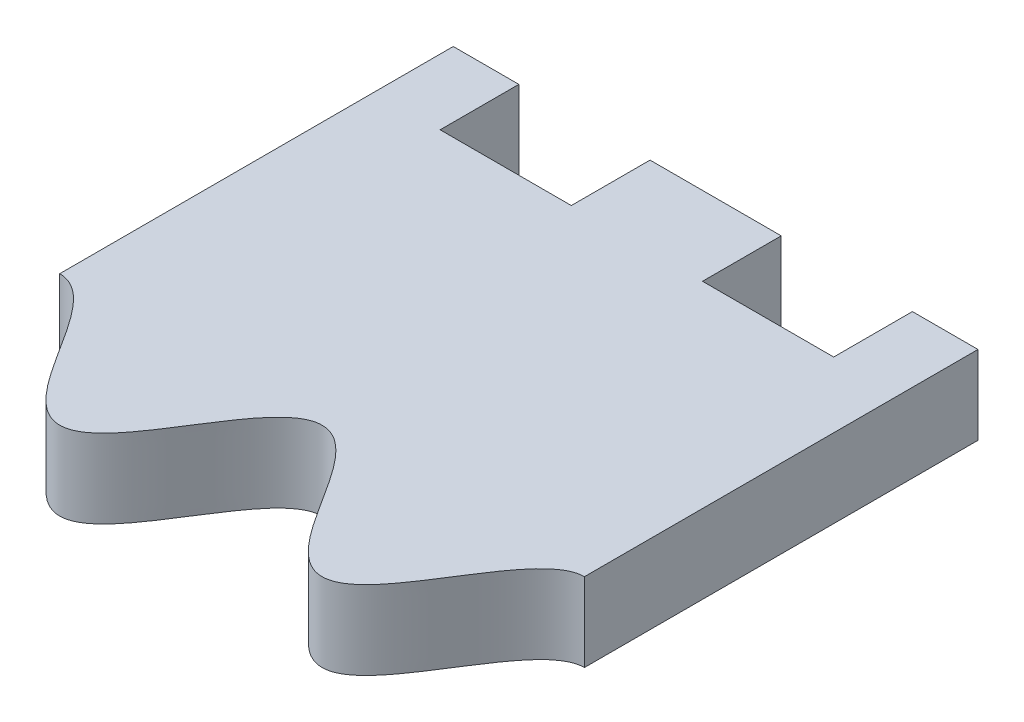
ISO-10303-21;
HEADER;
FILE_DESCRIPTION(('STEP AP214'),'2;1');
FILE_NAME('part.step','',(''),(''),'','','');
FILE_SCHEMA(('AUTOMOTIVE_DESIGN { 1 0 10303 214 1 1 1 1 }'));
ENDSEC;
DATA;
#1=APPLICATION_CONTEXT('core data for automotive mechanical design processes');
#2=APPLICATION_PROTOCOL_DEFINITION('international standard','automotive_design',2000,#1);
#3=PRODUCT_CONTEXT('',#1,'mechanical');
#4=PRODUCT('Part','Part','',(#3));
#5=PRODUCT_RELATED_PRODUCT_CATEGORY('part','',(#4));
#6=PRODUCT_DEFINITION_FORMATION('','',#4);
#7=PRODUCT_DEFINITION_CONTEXT('part definition',#1,'design');
#8=PRODUCT_DEFINITION('design','',#6,#7);
#9=PRODUCT_DEFINITION_SHAPE('','',#8);
#10=(LENGTH_UNIT() NAMED_UNIT(*) SI_UNIT(.MILLI.,.METRE.));
#11=(NAMED_UNIT(*) PLANE_ANGLE_UNIT() SI_UNIT($,.RADIAN.));
#12=(NAMED_UNIT(*) SI_UNIT($,.STERADIAN.) SOLID_ANGLE_UNIT());
#13=UNCERTAINTY_MEASURE_WITH_UNIT(LENGTH_MEASURE(1.E-05),#10,'distance_accuracy_value','');
#14=(GEOMETRIC_REPRESENTATION_CONTEXT(3) GLOBAL_UNCERTAINTY_ASSIGNED_CONTEXT((#13)) GLOBAL_UNIT_ASSIGNED_CONTEXT((#10,
#11,#12)) REPRESENTATION_CONTEXT('',''));
#15=CARTESIAN_POINT('',(0.,0.,0.));
#16=DIRECTION('',(0.,0.,1.));
#17=DIRECTION('',(1.,0.,0.));
#18=AXIS2_PLACEMENT_3D('',#15,#16,#17);
#19=CARTESIAN_POINT('',(0.,3.,0.));
#20=DIRECTION('',(0.,-1.,0.));
#21=DIRECTION('',(0.,0.,-1.));
#22=AXIS2_PLACEMENT_3D('',#19,#20,#21);
#23=PLANE('',#22);
#24=DIRECTION('',(0.,0.,-1.));
#25=VECTOR('',#24,1.);
#26=CARTESIAN_POINT('',(7.49999999999999,3.,0.));
#27=LINE('',#26,#25);
#28=CARTESIAN_POINT('',(7.5,3.,-7.));
#29=VERTEX_POINT('',#28);
#30=CARTESIAN_POINT('',(7.5,3.,-10.));
#31=VERTEX_POINT('',#30);
#32=EDGE_CURVE('E134',#29,#31,#27,.T.);
#33=ORIENTED_EDGE('',*,*,#32,.F.);
#34=DIRECTION('',(1.,0.,0.));
#35=VECTOR('',#34,1.);
#36=CARTESIAN_POINT('',(0.,3.,-7.));
#37=LINE('',#36,#35);
#38=CARTESIAN_POINT('',(2.5,3.,-7.));
#39=VERTEX_POINT('',#38);
#40=EDGE_CURVE('E247',#39,#29,#37,.T.);
#41=ORIENTED_EDGE('',*,*,#40,.F.);
#42=DIRECTION('',(0.,0.,1.));
#43=VECTOR('',#42,1.);
#44=CARTESIAN_POINT('',(2.5,3.,0.));
#45=LINE('',#44,#43);
#46=CARTESIAN_POINT('',(2.5,3.,-10.));
#47=VERTEX_POINT('',#46);
#48=EDGE_CURVE('E250',#47,#39,#45,.T.);
#49=ORIENTED_EDGE('',*,*,#48,.F.);
#50=DIRECTION('',(-1.,0.,0.));
#51=VECTOR('',#50,1.);
#52=CARTESIAN_POINT('',(-10.,3.,-10.));
#53=LINE('',#52,#51);
#54=CARTESIAN_POINT('',(-2.5,3.,-10.));
#55=VERTEX_POINT('',#54);
#56=EDGE_CURVE('E59',#47,#55,#53,.T.);
#57=ORIENTED_EDGE('',*,*,#56,.T.);
#58=DIRECTION('',(0.,0.,1.));
#59=VECTOR('',#58,1.);
#60=CARTESIAN_POINT('',(-2.5,3.,0.));
#61=LINE('',#60,#59);
#62=CARTESIAN_POINT('',(-2.5,3.,-7.));
#63=VERTEX_POINT('',#62);
#64=EDGE_CURVE('E226',#55,#63,#61,.T.);
#65=ORIENTED_EDGE('',*,*,#64,.T.);
#66=DIRECTION('',(-1.,0.,0.));
#67=VECTOR('',#66,1.);
#68=CARTESIAN_POINT('',(0.,3.,-7.));
#69=LINE('',#68,#67);
#70=CARTESIAN_POINT('',(-7.5,3.,-7.));
#71=VERTEX_POINT('',#70);
#72=EDGE_CURVE('E186',#63,#71,#69,.T.);
#73=ORIENTED_EDGE('',*,*,#72,.T.);
#74=DIRECTION('',(0.,0.,-1.));
#75=VECTOR('',#74,1.);
#76=CARTESIAN_POINT('',(-7.49999999999999,3.,0.));
#77=LINE('',#76,#75);
#78=CARTESIAN_POINT('',(-7.5,3.,-10.));
#79=VERTEX_POINT('',#78);
#80=EDGE_CURVE('E223',#71,#79,#77,.T.);
#81=ORIENTED_EDGE('',*,*,#80,.T.);
#82=CARTESIAN_POINT('',(-10.,3.,-10.));
#83=VERTEX_POINT('',#82);
#84=EDGE_CURVE('E175',#79,#83,#53,.T.);
#85=ORIENTED_EDGE('',*,*,#84,.T.);
#86=DIRECTION('',(0.,0.,1.));
#87=VECTOR('',#86,1.);
#88=CARTESIAN_POINT('',(-10.,3.,10.));
#89=LINE('',#88,#87);
#90=CARTESIAN_POINT('',(-9.99999999965552,3.,5.));
#91=VERTEX_POINT('',#90);
#92=EDGE_CURVE('E170',#83,#91,#89,.T.);
#93=ORIENTED_EDGE('',*,*,#92,.T.);
#94=CARTESIAN_POINT('',(-9.99999999931104,3.,5.));
#95=CARTESIAN_POINT('',(-9.99082001437918,3.,5.));
#96=CARTESIAN_POINT('',(-9.97244635755843,3.,5.00031258280608));
#97=CARTESIAN_POINT('',(-9.93938747114682,3.,5.0017192065243));
#98=CARTESIAN_POINT('',(-9.89196951877511,3.,5.00545484638884));
#99=CARTESIAN_POINT('',(-9.83592223774,3.,5.01241231200123));
#100=CARTESIAN_POINT('',(-9.77303376701536,3.,5.0243360940524));
#101=CARTESIAN_POINT('',(-9.69889854113709,3.,5.04321948192614));
#102=CARTESIAN_POINT('',(-9.61604277433707,3.,5.07104387662175));
#103=CARTESIAN_POINT('',(-9.51539692492575,3.,5.11282490925097));
#104=CARTESIAN_POINT('',(-9.38733060556712,3.,5.17887883126997));
#105=CARTESIAN_POINT('',(-9.23713055985856,3.,5.27635471018832));
#106=CARTESIAN_POINT('',(-9.06996834134291,3.,5.40982332741547));
#107=CARTESIAN_POINT('',(-8.90457564809527,3.,5.56508434026283));
#108=CARTESIAN_POINT('',(-8.7489612287523,3.,5.73006325874342));
#109=CARTESIAN_POINT('',(-8.60130778536925,3.,5.90213684094534));
#110=CARTESIAN_POINT('',(-8.46007700944654,3.,6.07949551678153));
#111=CARTESIAN_POINT('',(-8.32404000169283,3.,6.26084497150106));
#112=CARTESIAN_POINT('',(-8.18265527581067,3.,6.45853429864135));
#113=CARTESIAN_POINT('',(-8.03590703117052,3.,6.67241814731907));
#114=CARTESIAN_POINT('',(-7.88348141853783,3.,6.90219128809631));
#115=CARTESIAN_POINT('',(-7.72477345486102,3.,7.14737774531498));
#116=CARTESIAN_POINT('',(-7.52835049489709,3.,7.45513225242725));
#117=CARTESIAN_POINT('',(-7.2935706466482,3.,7.8250015959));
#118=CARTESIAN_POINT('',(-7.03464620121291,3.,8.2260611788318));
#119=CARTESIAN_POINT('',(-6.74300148875256,3.,8.65253335255465));
#120=CARTESIAN_POINT('',(-6.45275627161435,3.,9.0386496761071));
#121=CARTESIAN_POINT('',(-6.15977928798915,3.,9.37945193691896));
#122=CARTESIAN_POINT('',(-5.85167297950494,3.,9.66936159789187));
#123=CARTESIAN_POINT('',(-5.52099911676154,3.,9.88951274625956));
#124=CARTESIAN_POINT('',(-5.16718469959597,3.,10.0107796048101));
#125=CARTESIAN_POINT('',(-4.81669827132216,3.,10.0082047149901));
#126=CARTESIAN_POINT('',(-4.46319800184277,3.,9.88148028990629));
#127=CARTESIAN_POINT('',(-4.13245941221351,3.,9.65630351845059));
#128=CARTESIAN_POINT('',(-3.82518617782554,3.,9.36337460129456));
#129=CARTESIAN_POINT('',(-3.53356604995753,3.,9.02140752316623));
#130=CARTESIAN_POINT('',(-3.24460958171085,3.,8.63501856258895));
#131=CARTESIAN_POINT('',(-2.95419813160473,3.,8.20909034918839));
#132=CARTESIAN_POINT('',(-2.65686698526825,3.,7.74795426612715));
#133=CARTESIAN_POINT('',(-2.34581471696202,3.,7.25627199583769));
#134=CARTESIAN_POINT('',(-2.04855364815221,3.,6.79509133401284));
#135=CARTESIAN_POINT('',(-1.75827897641475,3.,6.36907074495268));
#136=CARTESIAN_POINT('',(-1.46954105510516,3.,5.98252143809928));
#137=CARTESIAN_POINT('',(-1.17822395531635,3.,5.64030017025521));
#138=CARTESIAN_POINT('',(-0.871397135841551,3.,5.34692679658111));
#139=CARTESIAN_POINT('',(-0.541242946949233,3.,5.12094954109834));
#140=CARTESIAN_POINT('',(-0.188339321343954,3.,4.99278354485659));
#141=CARTESIAN_POINT('',(0.162127550098853,3.,4.98833930062318));
#142=CARTESIAN_POINT('',(0.516516058955745,3.,5.10812379820319));
#143=CARTESIAN_POINT('',(0.847789499972692,3.,5.32744136166359));
#144=CARTESIAN_POINT('',(1.15633761061201,3.,5.6169010175441));
#145=CARTESIAN_POINT('',(1.44964940090906,3.,5.95742231082353));
#146=CARTESIAN_POINT('',(1.74008086012842,3.,6.34340524055233));
#147=CARTESIAN_POINT('',(2.03192959783582,3.,6.76972875296932));
#148=CARTESIAN_POINT('',(2.40964594109057,3.,7.35487850542105));
#149=CARTESIAN_POINT('',(2.78090922982973,3.,7.94523233006462));
#150=CARTESIAN_POINT('',(3.14574990729865,3.,8.50129399252891));
#151=CARTESIAN_POINT('',(3.52329318896242,3.,9.00864727130667));
#152=CARTESIAN_POINT('',(3.81685925310001,3.,9.35461538527141));
#153=CARTESIAN_POINT('',(4.12602543551394,3.,9.65125911623179));
#154=CARTESIAN_POINT('',(4.4589635091427,3.,9.87955606813572));
#155=CARTESIAN_POINT('',(4.81453515306973,3.,10.0080970607132));
#156=CARTESIAN_POINT('',(5.16651906223438,3.,10.0110153151384));
#157=CARTESIAN_POINT('',(5.52099605302878,3.,9.8895087562826));
#158=CARTESIAN_POINT('',(5.8516752952148,3.,9.6693644201522));
#159=CARTESIAN_POINT('',(6.15977743094213,3.,9.37944993871306));
#160=CARTESIAN_POINT('',(6.45275759757276,3.,9.03865066000419));
#161=CARTESIAN_POINT('',(6.7430002688316,3.,8.65253306261331));
#162=CARTESIAN_POINT('',(7.03464770147423,3.,8.2260608059929));
#163=CARTESIAN_POINT('',(7.33317530977178,3.,7.76365385774044));
#164=CARTESIAN_POINT('',(7.60642338358273,3.,7.3317214480071));
#165=CARTESIAN_POINT('',(7.84311922279969,3.,6.96303763204388));
#166=CARTESIAN_POINT('',(8.03590493109137,3.,6.67241958663214));
#167=CARTESIAN_POINT('',(8.18265718418306,3.,6.45853340349873));
#168=CARTESIAN_POINT('',(8.32403784221397,3.,6.26084548509797));
#169=CARTESIAN_POINT('',(8.46008017960912,3.,6.0794952510917));
#170=CARTESIAN_POINT('',(8.60130281900421,3.,5.90213690838074));
#171=CARTESIAN_POINT('',(8.74896919321557,3.,5.73006337300852));
#172=CARTESIAN_POINT('',(8.90456309324699,3.,5.56508402919109));
#173=CARTESIAN_POINT('',(9.06998641092107,3.,5.40982383276834));
#174=CARTESIAN_POINT('',(9.23710257708555,3.,5.2763538880521));
#175=CARTESIAN_POINT('',(9.40569368871927,3.,5.16699305416285));
#176=CARTESIAN_POINT('',(9.55451652275392,3.,5.09347750486071));
#177=CARTESIAN_POINT('',(9.67766268892188,3.,5.04861308650827));
#178=CARTESIAN_POINT('',(9.7730485325158,3.,5.02433654212541));
#179=CARTESIAN_POINT('',(9.83592168274235,3.,5.01241229509332));
#180=CARTESIAN_POINT('',(9.89196848201379,3.,5.00545481487434));
#181=CARTESIAN_POINT('',(9.93938704672832,3.,5.00171919360456));
#182=CARTESIAN_POINT('',(9.97244631431849,3.,5.00031258145348));
#183=CARTESIAN_POINT('',(9.99082001575711,3.,5.));
#184=CARTESIAN_POINT('',(10.000000000689,3.,5.));
#185=B_SPLINE_CURVE_WITH_KNOTS('',4,(#94,#95,#96,#97,#98,#99,#100,#101,#102,#103,#104,#105,#106,
#107,#108,#109,#110,#111,#112,#113,#114,#115,#116,#117,#118,#119,#120,#121,#122,#123,#124,#125,
#126,#127,#128,#129,#130,#131,#132,#133,#134,#135,#136,#137,#138,#139,#140,#141,#142,#143,#144,
#145,#146,#147,#148,#149,#150,#151,#152,#153,#154,#155,#156,#157,#158,#159,#160,#161,#162,#163,
#164,#165,#166,#167,#168,#169,#170,#171,#172,#173,#174,#175,#176,#177,#178,#179,#180,#181,#182,
#183,#184),.UNSPECIFIED.,.F.,.F.,(5,1,1,1,1,1,1,1,1,1,1,1,1,1,1,1,1,1,1,1,1,1,1,1,1,1,1,1,1,1,1,
1,1,1,1,1,1,1,1,1,1,1,1,1,1,1,1,1,1,1,1,1,1,1,1,1,1,1,1,1,1,1,1,1,1,1,1,1,1,1,1,1,1,1,1,1,1,1,1,
1,1,1,1,1,1,1,1,5),(0.0788154969069754,0.0800698558664366,0.0813242147984401,0.0825785737304436,
0.0838329326624472,0.0863416505264542,0.0888503683904613,0.0913590862544684,0.0938678041184755,
0.0988852398464896,0.105408028363832,0.111930816881175,0.118453605398517,0.12497639391586,
0.131499182433202,0.138021970950545,0.144544759467888,0.15106754798523,0.159472005704982,
0.167876463424733,0.176280921144484,0.184685378864236,0.201494294303738,0.218303209743241,
0.231223727279946,0.24414424481665,0.257064762353355,0.26998527989006,0.27976852467509,
0.28955176946012,0.299506241208716,0.309460712957312,0.322382190403877,0.335303667850441,
0.348225145297005,0.361146622743569,0.377889240891207,0.394631859038846,0.411374477186485,
0.428117095334123,0.441038583364772,0.45396007139542,0.466881559426069,0.479803047456718,
0.489757500982272,0.499711954507825,0.509495207864302,0.519278461220779,0.532198991532702,
0.545119521844626,0.55804005215655,0.570960582468474,0.587769475723957,0.60457836897944,
0.638196155490407,0.65124175130361,0.664287347116814,0.677332942930017,0.690378538743221,
0.700413384641552,0.710448230539883,0.720231475324913,0.730014720109944,0.742935237646649,
0.755855755183354,0.768776272720059,0.781696790256764,0.798505705696267,0.815314621135769,
0.832123536575272,0.840527994295023,0.848932452014775,0.855455240532117,0.861978029049459,
0.868500817566802,0.875023606084144,0.881546394601487,0.888069183118829,0.894591971636172,
0.901114760153514,0.906132195881528,0.911149631609542,0.913658349473549,0.916167067337556,
0.91742142626956,0.918675785201563,0.919930144133567,0.921184503042035),.UNSPECIFIED.);
#186=CARTESIAN_POINT('',(10.0000000003445,3.,5.));
#187=VERTEX_POINT('',#186);
#188=EDGE_CURVE('E37',#91,#187,#185,.T.);
#189=ORIENTED_EDGE('',*,*,#188,.T.);
#190=DIRECTION('',(0.,0.,-1.));
#191=VECTOR('',#190,1.);
#192=CARTESIAN_POINT('',(10.,3.,10.));
#193=LINE('',#192,#191);
#194=CARTESIAN_POINT('',(10.,3.,-10.));
#195=VERTEX_POINT('',#194);
#196=EDGE_CURVE('E156',#187,#195,#193,.T.);
#197=ORIENTED_EDGE('',*,*,#196,.T.);
#198=EDGE_CURVE('E173',#195,#31,#53,.T.);
#199=ORIENTED_EDGE('',*,*,#198,.T.);
#200=EDGE_LOOP('',(#33,#41,#49,#57,#65,#73,#81,#85,#93,#189,#197,#199));
#201=FACE_BOUND('',#200,.T.);
#202=ADVANCED_FACE('F33',(#201),#23,.F.);
#203=CARTESIAN_POINT('',(0.,0.,0.));
#204=DIRECTION('',(0.,-1.,0.));
#205=DIRECTION('',(0.,0.,-1.));
#206=AXIS2_PLACEMENT_3D('',#203,#204,#205);
#207=PLANE('',#206);
#208=DIRECTION('',(-1.,0.,0.));
#209=VECTOR('',#208,1.);
#210=CARTESIAN_POINT('',(7.5,0.,-7.));
#211=LINE('',#210,#209);
#212=CARTESIAN_POINT('',(7.5,0.,-7.));
#213=VERTEX_POINT('',#212);
#214=CARTESIAN_POINT('',(2.5,0.,-7.));
#215=VERTEX_POINT('',#214);
#216=EDGE_CURVE('E140',#213,#215,#211,.T.);
#217=ORIENTED_EDGE('',*,*,#216,.F.);
#218=DIRECTION('',(0.,0.,1.));
#219=VECTOR('',#218,1.);
#220=CARTESIAN_POINT('',(7.5,0.,-10.));
#221=LINE('',#220,#219);
#222=CARTESIAN_POINT('',(7.5,0.,-10.));
#223=VERTEX_POINT('',#222);
#224=EDGE_CURVE('E131',#223,#213,#221,.T.);
#225=ORIENTED_EDGE('',*,*,#224,.F.);
#226=DIRECTION('',(-1.,0.,0.));
#227=VECTOR('',#226,1.);
#228=CARTESIAN_POINT('',(-10.,0.,-10.));
#229=LINE('',#228,#227);
#230=CARTESIAN_POINT('',(10.,0.,-10.));
#231=VERTEX_POINT('',#230);
#232=EDGE_CURVE('E147',#231,#223,#229,.T.);
#233=ORIENTED_EDGE('',*,*,#232,.F.);
#234=DIRECTION('',(0.,0.,-1.));
#235=VECTOR('',#234,1.);
#236=CARTESIAN_POINT('',(10.,0.,10.));
#237=LINE('',#236,#235);
#238=CARTESIAN_POINT('',(10.,0.,5.));
#239=VERTEX_POINT('',#238);
#240=EDGE_CURVE('E159',#239,#231,#237,.T.);
#241=ORIENTED_EDGE('',*,*,#240,.F.);
#242=CARTESIAN_POINT('',(-9.99999999931104,0.,5.));
#243=CARTESIAN_POINT('',(-9.99082001437918,0.,5.));
#244=CARTESIAN_POINT('',(-9.97244635755843,0.,5.00031258280608));
#245=CARTESIAN_POINT('',(-9.93938747114682,0.,5.0017192065243));
#246=CARTESIAN_POINT('',(-9.89196951877511,0.,5.00545484638884));
#247=CARTESIAN_POINT('',(-9.83592223774,0.,5.01241231200123));
#248=CARTESIAN_POINT('',(-9.77303376701536,0.,5.0243360940524));
#249=CARTESIAN_POINT('',(-9.69889854113709,0.,5.04321948192614));
#250=CARTESIAN_POINT('',(-9.61604277433707,0.,5.07104387662175));
#251=CARTESIAN_POINT('',(-9.51539692492575,0.,5.11282490925097));
#252=CARTESIAN_POINT('',(-9.38733060556712,0.,5.17887883126997));
#253=CARTESIAN_POINT('',(-9.23713055985856,0.,5.27635471018832));
#254=CARTESIAN_POINT('',(-9.06996834134291,0.,5.40982332741547));
#255=CARTESIAN_POINT('',(-8.90457564809527,0.,5.56508434026283));
#256=CARTESIAN_POINT('',(-8.7489612287523,0.,5.73006325874342));
#257=CARTESIAN_POINT('',(-8.60130778536925,0.,5.90213684094534));
#258=CARTESIAN_POINT('',(-8.46007700944654,0.,6.07949551678153));
#259=CARTESIAN_POINT('',(-8.32404000169283,0.,6.26084497150106));
#260=CARTESIAN_POINT('',(-8.18265527581067,0.,6.45853429864135));
#261=CARTESIAN_POINT('',(-8.03590703117052,0.,6.67241814731907));
#262=CARTESIAN_POINT('',(-7.88348141853783,0.,6.90219128809631));
#263=CARTESIAN_POINT('',(-7.72477345486102,0.,7.14737774531498));
#264=CARTESIAN_POINT('',(-7.52835049489709,0.,7.45513225242725));
#265=CARTESIAN_POINT('',(-7.2935706466482,0.,7.8250015959));
#266=CARTESIAN_POINT('',(-7.03464620121291,0.,8.2260611788318));
#267=CARTESIAN_POINT('',(-6.74300148875256,0.,8.65253335255465));
#268=CARTESIAN_POINT('',(-6.45275627161435,0.,9.0386496761071));
#269=CARTESIAN_POINT('',(-6.15977928798915,0.,9.37945193691896));
#270=CARTESIAN_POINT('',(-5.85167297950494,0.,9.66936159789187));
#271=CARTESIAN_POINT('',(-5.52099911676154,0.,9.88951274625956));
#272=CARTESIAN_POINT('',(-5.16718469959597,0.,10.0107796048101));
#273=CARTESIAN_POINT('',(-4.81669827132216,0.,10.0082047149901));
#274=CARTESIAN_POINT('',(-4.46319800184277,0.,9.88148028990629));
#275=CARTESIAN_POINT('',(-4.13245941221351,0.,9.65630351845059));
#276=CARTESIAN_POINT('',(-3.82518617782554,0.,9.36337460129456));
#277=CARTESIAN_POINT('',(-3.53356604995753,0.,9.02140752316623));
#278=CARTESIAN_POINT('',(-3.24460958171085,0.,8.63501856258895));
#279=CARTESIAN_POINT('',(-2.95419813160473,0.,8.20909034918839));
#280=CARTESIAN_POINT('',(-2.65686698526825,0.,7.74795426612715));
#281=CARTESIAN_POINT('',(-2.34581471696202,0.,7.25627199583769));
#282=CARTESIAN_POINT('',(-2.04855364815221,0.,6.79509133401284));
#283=CARTESIAN_POINT('',(-1.75827897641475,0.,6.36907074495268));
#284=CARTESIAN_POINT('',(-1.46954105510516,0.,5.98252143809928));
#285=CARTESIAN_POINT('',(-1.17822395531635,0.,5.64030017025521));
#286=CARTESIAN_POINT('',(-0.871397135841551,0.,5.34692679658111));
#287=CARTESIAN_POINT('',(-0.541242946949233,0.,5.12094954109834));
#288=CARTESIAN_POINT('',(-0.188339321343954,0.,4.99278354485659));
#289=CARTESIAN_POINT('',(0.162127550098853,0.,4.98833930062318));
#290=CARTESIAN_POINT('',(0.516516058955745,0.,5.10812379820319));
#291=CARTESIAN_POINT('',(0.847789499972692,0.,5.32744136166359));
#292=CARTESIAN_POINT('',(1.15633761061201,0.,5.6169010175441));
#293=CARTESIAN_POINT('',(1.44964940090906,0.,5.95742231082353));
#294=CARTESIAN_POINT('',(1.74008086012842,0.,6.34340524055233));
#295=CARTESIAN_POINT('',(2.03192959783582,0.,6.76972875296932));
#296=CARTESIAN_POINT('',(2.40964594109057,0.,7.35487850542105));
#297=CARTESIAN_POINT('',(2.78090922982973,0.,7.94523233006462));
#298=CARTESIAN_POINT('',(3.14574990729865,0.,8.50129399252891));
#299=CARTESIAN_POINT('',(3.52329318896242,0.,9.00864727130667));
#300=CARTESIAN_POINT('',(3.81685925310001,0.,9.35461538527141));
#301=CARTESIAN_POINT('',(4.12602543551394,0.,9.65125911623179));
#302=CARTESIAN_POINT('',(4.4589635091427,0.,9.87955606813572));
#303=CARTESIAN_POINT('',(4.81453515306973,0.,10.0080970607132));
#304=CARTESIAN_POINT('',(5.16651906223438,0.,10.0110153151384));
#305=CARTESIAN_POINT('',(5.52099605302878,0.,9.8895087562826));
#306=CARTESIAN_POINT('',(5.8516752952148,0.,9.6693644201522));
#307=CARTESIAN_POINT('',(6.15977743094213,0.,9.37944993871306));
#308=CARTESIAN_POINT('',(6.45275759757276,0.,9.03865066000419));
#309=CARTESIAN_POINT('',(6.7430002688316,0.,8.65253306261331));
#310=CARTESIAN_POINT('',(7.03464770147423,0.,8.2260608059929));
#311=CARTESIAN_POINT('',(7.33317530977178,0.,7.76365385774044));
#312=CARTESIAN_POINT('',(7.60642338358273,0.,7.3317214480071));
#313=CARTESIAN_POINT('',(7.84311922279969,0.,6.96303763204388));
#314=CARTESIAN_POINT('',(8.03590493109137,0.,6.67241958663214));
#315=CARTESIAN_POINT('',(8.18265718418306,0.,6.45853340349873));
#316=CARTESIAN_POINT('',(8.32403784221397,0.,6.26084548509797));
#317=CARTESIAN_POINT('',(8.46008017960912,0.,6.0794952510917));
#318=CARTESIAN_POINT('',(8.60130281900421,0.,5.90213690838074));
#319=CARTESIAN_POINT('',(8.74896919321557,0.,5.73006337300852));
#320=CARTESIAN_POINT('',(8.90456309324699,0.,5.56508402919109));
#321=CARTESIAN_POINT('',(9.06998641092107,0.,5.40982383276834));
#322=CARTESIAN_POINT('',(9.23710257708555,0.,5.2763538880521));
#323=CARTESIAN_POINT('',(9.40569368871927,0.,5.16699305416285));
#324=CARTESIAN_POINT('',(9.55451652275392,0.,5.09347750486071));
#325=CARTESIAN_POINT('',(9.67766268892188,0.,5.04861308650827));
#326=CARTESIAN_POINT('',(9.7730485325158,0.,5.02433654212541));
#327=CARTESIAN_POINT('',(9.83592168274235,0.,5.01241229509332));
#328=CARTESIAN_POINT('',(9.89196848201379,0.,5.00545481487434));
#329=CARTESIAN_POINT('',(9.93938704672832,0.,5.00171919360456));
#330=CARTESIAN_POINT('',(9.97244631431849,0.,5.00031258145348));
#331=CARTESIAN_POINT('',(9.99082001575711,0.,5.));
#332=CARTESIAN_POINT('',(10.000000000689,0.,5.));
#333=B_SPLINE_CURVE_WITH_KNOTS('',4,(#242,#243,#244,#245,#246,#247,#248,#249,#250,#251,#252,
#253,#254,#255,#256,#257,#258,#259,#260,#261,#262,#263,#264,#265,#266,#267,#268,#269,#270,#271,
#272,#273,#274,#275,#276,#277,#278,#279,#280,#281,#282,#283,#284,#285,#286,#287,#288,#289,#290,
#291,#292,#293,#294,#295,#296,#297,#298,#299,#300,#301,#302,#303,#304,#305,#306,#307,#308,#309,
#310,#311,#312,#313,#314,#315,#316,#317,#318,#319,#320,#321,#322,#323,#324,#325,#326,#327,#328,
#329,#330,#331,#332),.UNSPECIFIED.,.F.,.F.,(5,1,1,1,1,1,1,1,1,1,1,1,1,1,1,1,1,1,1,1,1,1,1,1,1,1,
1,1,1,1,1,1,1,1,1,1,1,1,1,1,1,1,1,1,1,1,1,1,1,1,1,1,1,1,1,1,1,1,1,1,1,1,1,1,1,1,1,1,1,1,1,1,1,1,
1,1,1,1,1,1,1,1,1,1,1,1,1,5),(0.0788154969069754,0.0800698558664366,0.0813242147984401,
0.0825785737304436,0.0838329326624472,0.0863416505264542,0.0888503683904613,0.0913590862544684,
0.0938678041184755,0.0988852398464896,0.105408028363832,0.111930816881175,0.118453605398517,
0.12497639391586,0.131499182433202,0.138021970950545,0.144544759467888,0.15106754798523,
0.159472005704982,0.167876463424733,0.176280921144484,0.184685378864236,0.201494294303738,
0.218303209743241,0.231223727279946,0.24414424481665,0.257064762353355,0.26998527989006,
0.27976852467509,0.28955176946012,0.299506241208716,0.309460712957312,0.322382190403877,
0.335303667850441,0.348225145297005,0.361146622743569,0.377889240891207,0.394631859038846,
0.411374477186485,0.428117095334123,0.441038583364772,0.45396007139542,0.466881559426069,
0.479803047456718,0.489757500982272,0.499711954507825,0.509495207864302,0.519278461220779,
0.532198991532702,0.545119521844626,0.55804005215655,0.570960582468474,0.587769475723957,
0.60457836897944,0.638196155490407,0.65124175130361,0.664287347116814,0.677332942930017,
0.690378538743221,0.700413384641552,0.710448230539883,0.720231475324913,0.730014720109944,
0.742935237646649,0.755855755183354,0.768776272720059,0.781696790256764,0.798505705696267,
0.815314621135769,0.832123536575272,0.840527994295023,0.848932452014775,0.855455240532117,
0.861978029049459,0.868500817566802,0.875023606084144,0.881546394601487,0.888069183118829,
0.894591971636172,0.901114760153514,0.906132195881528,0.911149631609542,0.913658349473549,
0.916167067337556,0.91742142626956,0.918675785201563,0.919930144133567,0.921184503042035),.UNSPECIFIED.);
#334=CARTESIAN_POINT('',(-10.,0.,5.));
#335=VERTEX_POINT('',#334);
#336=EDGE_CURVE('E181',#335,#239,#333,.T.);
#337=ORIENTED_EDGE('',*,*,#336,.F.);
#338=DIRECTION('',(0.,0.,1.));
#339=VECTOR('',#338,1.);
#340=CARTESIAN_POINT('',(-10.,0.,10.));
#341=LINE('',#340,#339);
#342=CARTESIAN_POINT('',(-10.,0.,-10.));
#343=VERTEX_POINT('',#342);
#344=EDGE_CURVE('E151',#343,#335,#341,.T.);
#345=ORIENTED_EDGE('',*,*,#344,.F.);
#346=CARTESIAN_POINT('',(-7.5,0.,-10.));
#347=VERTEX_POINT('',#346);
#348=EDGE_CURVE('E154',#347,#343,#229,.T.);
#349=ORIENTED_EDGE('',*,*,#348,.F.);
#350=DIRECTION('',(0.,0.,1.));
#351=VECTOR('',#350,1.);
#352=CARTESIAN_POINT('',(-7.5,0.,-10.));
#353=LINE('',#352,#351);
#354=CARTESIAN_POINT('',(-7.5,0.,-7.));
#355=VERTEX_POINT('',#354);
#356=EDGE_CURVE('E244',#347,#355,#353,.T.);
#357=ORIENTED_EDGE('',*,*,#356,.T.);
#358=DIRECTION('',(1.,0.,0.));
#359=VECTOR('',#358,1.);
#360=CARTESIAN_POINT('',(-7.5,0.,-7.));
#361=LINE('',#360,#359);
#362=CARTESIAN_POINT('',(-2.5,0.,-7.));
#363=VERTEX_POINT('',#362);
#364=EDGE_CURVE('E241',#355,#363,#361,.T.);
#365=ORIENTED_EDGE('',*,*,#364,.T.);
#366=DIRECTION('',(0.,0.,-1.));
#367=VECTOR('',#366,1.);
#368=CARTESIAN_POINT('',(-2.5,0.,-10.));
#369=LINE('',#368,#367);
#370=CARTESIAN_POINT('',(-2.5,0.,-10.));
#371=VERTEX_POINT('',#370);
#372=EDGE_CURVE('E232',#363,#371,#369,.T.);
#373=ORIENTED_EDGE('',*,*,#372,.T.);
#374=CARTESIAN_POINT('',(2.5,0.,-10.));
#375=VERTEX_POINT('',#374);
#376=EDGE_CURVE('E152',#375,#371,#229,.T.);
#377=ORIENTED_EDGE('',*,*,#376,.F.);
#378=DIRECTION('',(0.,0.,-1.));
#379=VECTOR('',#378,1.);
#380=CARTESIAN_POINT('',(2.5,0.,-10.));
#381=LINE('',#380,#379);
#382=EDGE_CURVE('E51',#215,#375,#381,.T.);
#383=ORIENTED_EDGE('',*,*,#382,.F.);
#384=EDGE_LOOP('',(#217,#225,#233,#241,#337,#345,#349,#357,#365,#373,#377,#383));
#385=FACE_BOUND('',#384,.T.);
#386=ADVANCED_FACE('F145',(#385),#207,.T.);
#387=CARTESIAN_POINT('',(-10.,3.,-10.));
#388=DIRECTION('',(0.,0.,1.));
#389=DIRECTION('',(1.,0.,0.));
#390=AXIS2_PLACEMENT_3D('',#387,#388,#389);
#391=PLANE('',#390);
#392=DIRECTION('',(0.,1.,0.));
#393=VECTOR('',#392,1.);
#394=CARTESIAN_POINT('',(7.5,0.,-10.));
#395=LINE('',#394,#393);
#396=EDGE_CURVE('E127',#223,#31,#395,.T.);
#397=ORIENTED_EDGE('',*,*,#396,.T.);
#398=ORIENTED_EDGE('',*,*,#198,.F.);
#399=DIRECTION('',(0.,-1.,0.));
#400=VECTOR('',#399,1.);
#401=CARTESIAN_POINT('',(10.,3.,-10.));
#402=LINE('',#401,#400);
#403=EDGE_CURVE('E11',#195,#231,#402,.T.);
#404=ORIENTED_EDGE('',*,*,#403,.T.);
#405=ORIENTED_EDGE('',*,*,#232,.T.);
#406=EDGE_LOOP('',(#397,#398,#404,#405));
#407=FACE_BOUND('',#406,.T.);
#408=ADVANCED_FACE('F149',(#407),#391,.F.);
#409=DIRECTION('',(0.,1.,0.));
#410=VECTOR('',#409,1.);
#411=CARTESIAN_POINT('',(2.5,0.,-10.));
#412=LINE('',#411,#410);
#413=EDGE_CURVE('E139',#375,#47,#412,.T.);
#414=ORIENTED_EDGE('',*,*,#413,.F.);
#415=ORIENTED_EDGE('',*,*,#376,.T.);
#416=DIRECTION('',(0.,1.,0.));
#417=VECTOR('',#416,1.);
#418=CARTESIAN_POINT('',(-2.5,0.,-10.));
#419=LINE('',#418,#417);
#420=EDGE_CURVE('E235',#371,#55,#419,.T.);
#421=ORIENTED_EDGE('',*,*,#420,.T.);
#422=ORIENTED_EDGE('',*,*,#56,.F.);
#423=EDGE_LOOP('',(#414,#415,#421,#422));
#424=FACE_BOUND('',#423,.T.);
#425=ADVANCED_FACE('F208',(#424),#391,.F.);
#426=ORIENTED_EDGE('',*,*,#84,.F.);
#427=DIRECTION('',(0.,1.,0.));
#428=VECTOR('',#427,1.);
#429=CARTESIAN_POINT('',(-7.5,0.,-10.));
#430=LINE('',#429,#428);
#431=EDGE_CURVE('E219',#347,#79,#430,.T.);
#432=ORIENTED_EDGE('',*,*,#431,.F.);
#433=ORIENTED_EDGE('',*,*,#348,.T.);
#434=DIRECTION('',(0.,-1.,0.));
#435=VECTOR('',#434,1.);
#436=CARTESIAN_POINT('',(-10.,3.,-10.));
#437=LINE('',#436,#435);
#438=EDGE_CURVE('E44',#83,#343,#437,.T.);
#439=ORIENTED_EDGE('',*,*,#438,.F.);
#440=EDGE_LOOP('',(#426,#432,#433,#439));
#441=FACE_BOUND('',#440,.T.);
#442=ADVANCED_FACE('F209',(#441),#391,.F.);
#443=CARTESIAN_POINT('',(10.,3.,10.));
#444=DIRECTION('',(-1.,0.,0.));
#445=DIRECTION('',(0.,0.,1.));
#446=AXIS2_PLACEMENT_3D('',#443,#444,#445);
#447=PLANE('',#446);
#448=DIRECTION('',(0.,1.,0.));
#449=VECTOR('',#448,1.);
#450=CARTESIAN_POINT('',(10.,0.,5.));
#451=LINE('',#450,#449);
#452=EDGE_CURVE('E168',#239,#187,#451,.T.);
#453=ORIENTED_EDGE('',*,*,#452,.F.);
#454=ORIENTED_EDGE('',*,*,#240,.T.);
#455=ORIENTED_EDGE('',*,*,#403,.F.);
#456=ORIENTED_EDGE('',*,*,#196,.F.);
#457=EDGE_LOOP('',(#453,#454,#455,#456));
#458=FACE_BOUND('',#457,.T.);
#459=ADVANCED_FACE('F35',(#458),#447,.F.);
#460=CARTESIAN_POINT('',(-10.,3.,10.));
#461=DIRECTION('',(1.,0.,0.));
#462=DIRECTION('',(0.,0.,-1.));
#463=AXIS2_PLACEMENT_3D('',#460,#461,#462);
#464=PLANE('',#463);
#465=DIRECTION('',(0.,1.,0.));
#466=VECTOR('',#465,1.);
#467=CARTESIAN_POINT('',(-10.,0.,5.));
#468=LINE('',#467,#466);
#469=EDGE_CURVE('E178',#335,#91,#468,.T.);
#470=ORIENTED_EDGE('',*,*,#469,.T.);
#471=ORIENTED_EDGE('',*,*,#92,.F.);
#472=ORIENTED_EDGE('',*,*,#438,.T.);
#473=ORIENTED_EDGE('',*,*,#344,.T.);
#474=EDGE_LOOP('',(#470,#471,#472,#473));
#475=FACE_BOUND('',#474,.T.);
#476=ADVANCED_FACE('F197',(#475),#464,.F.);
#477=DIRECTION('',(0.,1.,0.));
#478=VECTOR('',#477,1.);
#479=SURFACE_OF_LINEAR_EXTRUSION('',#333,#478);
#480=ORIENTED_EDGE('',*,*,#188,.F.);
#481=ORIENTED_EDGE('',*,*,#469,.F.);
#482=ORIENTED_EDGE('',*,*,#336,.T.);
#483=ORIENTED_EDGE('',*,*,#452,.T.);
#484=EDGE_LOOP('',(#480,#481,#482,#483));
#485=FACE_BOUND('',#484,.T.);
#486=ADVANCED_FACE('F192',(#485),#479,.T.);
#487=CARTESIAN_POINT('',(-7.5,0.,-7.));
#488=DIRECTION('',(0.,0.,1.));
#489=DIRECTION('',(1.,0.,0.));
#490=AXIS2_PLACEMENT_3D('',#487,#488,#489);
#491=PLANE('',#490);
#492=DIRECTION('',(0.,1.,0.));
#493=VECTOR('',#492,1.);
#494=CARTESIAN_POINT('',(-2.5,0.,-7.));
#495=LINE('',#494,#493);
#496=EDGE_CURVE('E231',#363,#63,#495,.T.);
#497=ORIENTED_EDGE('',*,*,#496,.F.);
#498=ORIENTED_EDGE('',*,*,#364,.F.);
#499=DIRECTION('',(0.,1.,0.));
#500=VECTOR('',#499,1.);
#501=CARTESIAN_POINT('',(-7.5,0.,-7.));
#502=LINE('',#501,#500);
#503=EDGE_CURVE('E229',#355,#71,#502,.T.);
#504=ORIENTED_EDGE('',*,*,#503,.T.);
#505=ORIENTED_EDGE('',*,*,#72,.F.);
#506=EDGE_LOOP('',(#497,#498,#504,#505));
#507=FACE_BOUND('',#506,.T.);
#508=ADVANCED_FACE('F196',(#507),#491,.F.);
#509=CARTESIAN_POINT('',(-7.5,0.,-10.));
#510=DIRECTION('',(-1.,0.,0.));
#511=DIRECTION('',(0.,0.,1.));
#512=AXIS2_PLACEMENT_3D('',#509,#510,#511);
#513=PLANE('',#512);
#514=ORIENTED_EDGE('',*,*,#503,.F.);
#515=ORIENTED_EDGE('',*,*,#356,.F.);
#516=ORIENTED_EDGE('',*,*,#431,.T.);
#517=ORIENTED_EDGE('',*,*,#80,.F.);
#518=EDGE_LOOP('',(#514,#515,#516,#517));
#519=FACE_BOUND('',#518,.T.);
#520=ADVANCED_FACE('F199',(#519),#513,.F.);
#521=CARTESIAN_POINT('',(-2.5,0.,-10.));
#522=DIRECTION('',(1.,0.,0.));
#523=DIRECTION('',(0.,0.,-1.));
#524=AXIS2_PLACEMENT_3D('',#521,#522,#523);
#525=PLANE('',#524);
#526=ORIENTED_EDGE('',*,*,#420,.F.);
#527=ORIENTED_EDGE('',*,*,#372,.F.);
#528=ORIENTED_EDGE('',*,*,#496,.T.);
#529=ORIENTED_EDGE('',*,*,#64,.F.);
#530=EDGE_LOOP('',(#526,#527,#528,#529));
#531=FACE_BOUND('',#530,.T.);
#532=ADVANCED_FACE('F267',(#531),#525,.F.);
#533=CARTESIAN_POINT('',(7.5,0.,-7.));
#534=DIRECTION('',(0.,0.,-1.));
#535=DIRECTION('',(-1.,0.,0.));
#536=AXIS2_PLACEMENT_3D('',#533,#534,#535);
#537=PLANE('',#536);
#538=ORIENTED_EDGE('',*,*,#40,.T.);
#539=DIRECTION('',(0.,1.,0.));
#540=VECTOR('',#539,1.);
#541=CARTESIAN_POINT('',(7.5,0.,-7.));
#542=LINE('',#541,#540);
#543=EDGE_CURVE('E251',#213,#29,#542,.T.);
#544=ORIENTED_EDGE('',*,*,#543,.F.);
#545=ORIENTED_EDGE('',*,*,#216,.T.);
#546=DIRECTION('',(0.,1.,0.));
#547=VECTOR('',#546,1.);
#548=CARTESIAN_POINT('',(2.5,0.,-7.));
#549=LINE('',#548,#547);
#550=EDGE_CURVE('E254',#215,#39,#549,.T.);
#551=ORIENTED_EDGE('',*,*,#550,.T.);
#552=EDGE_LOOP('',(#538,#544,#545,#551));
#553=FACE_BOUND('',#552,.T.);
#554=ADVANCED_FACE('F260',(#553),#537,.T.);
#555=CARTESIAN_POINT('',(7.5,0.,-10.));
#556=DIRECTION('',(-1.,0.,0.));
#557=DIRECTION('',(0.,0.,1.));
#558=AXIS2_PLACEMENT_3D('',#555,#556,#557);
#559=PLANE('',#558);
#560=ORIENTED_EDGE('',*,*,#32,.T.);
#561=ORIENTED_EDGE('',*,*,#396,.F.);
#562=ORIENTED_EDGE('',*,*,#224,.T.);
#563=ORIENTED_EDGE('',*,*,#543,.T.);
#564=EDGE_LOOP('',(#560,#561,#562,#563));
#565=FACE_BOUND('',#564,.T.);
#566=ADVANCED_FACE('F129',(#565),#559,.T.);
#567=CARTESIAN_POINT('',(2.5,0.,-10.));
#568=DIRECTION('',(1.,0.,0.));
#569=DIRECTION('',(0.,0.,-1.));
#570=AXIS2_PLACEMENT_3D('',#567,#568,#569);
#571=PLANE('',#570);
#572=ORIENTED_EDGE('',*,*,#48,.T.);
#573=ORIENTED_EDGE('',*,*,#550,.F.);
#574=ORIENTED_EDGE('',*,*,#382,.T.);
#575=ORIENTED_EDGE('',*,*,#413,.T.);
#576=EDGE_LOOP('',(#572,#573,#574,#575));
#577=FACE_BOUND('',#576,.T.);
#578=ADVANCED_FACE('F262',(#577),#571,.T.);
#579=CLOSED_SHELL('',(#202,#386,#408,#425,#442,#459,#476,#486,#508,#520,#532,#554,#566,#578));
#580=MANIFOLD_SOLID_BREP('B2',#579);
#581=ADVANCED_BREP_SHAPE_REPRESENTATION('',(#18,#580),#14);
#582=SHAPE_DEFINITION_REPRESENTATION(#9,#581);
ENDSEC;
END-ISO-10303-21;
